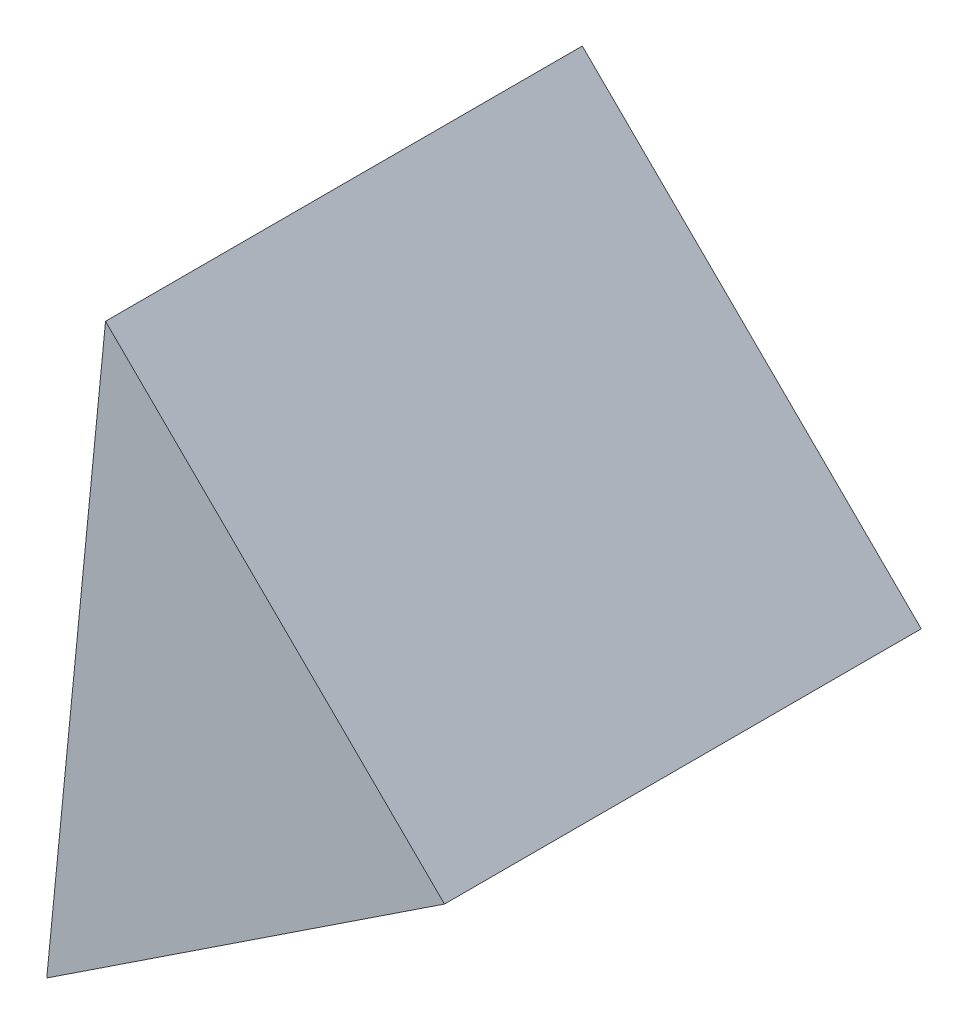
ISO-10303-21;
HEADER;
FILE_DESCRIPTION(('STEP AP214'),'2;1');
FILE_NAME('part.step','',(''),(''),'','','');
FILE_SCHEMA(('AUTOMOTIVE_DESIGN { 1 0 10303 214 1 1 1 1 }'));
ENDSEC;
DATA;
#1=APPLICATION_CONTEXT('core data for automotive mechanical design processes');
#2=APPLICATION_PROTOCOL_DEFINITION('international standard','automotive_design',2000,#1);
#3=PRODUCT_CONTEXT('',#1,'mechanical');
#4=PRODUCT('Part','Part','',(#3));
#5=PRODUCT_RELATED_PRODUCT_CATEGORY('part','',(#4));
#6=PRODUCT_DEFINITION_FORMATION('','',#4);
#7=PRODUCT_DEFINITION_CONTEXT('part definition',#1,'design');
#8=PRODUCT_DEFINITION('design','',#6,#7);
#9=PRODUCT_DEFINITION_SHAPE('','',#8);
#10=(LENGTH_UNIT() NAMED_UNIT(*) SI_UNIT(.MILLI.,.METRE.));
#11=(NAMED_UNIT(*) PLANE_ANGLE_UNIT() SI_UNIT($,.RADIAN.));
#12=(NAMED_UNIT(*) SI_UNIT($,.STERADIAN.) SOLID_ANGLE_UNIT());
#13=UNCERTAINTY_MEASURE_WITH_UNIT(LENGTH_MEASURE(1.E-05),#10,'distance_accuracy_value','');
#14=(GEOMETRIC_REPRESENTATION_CONTEXT(3) GLOBAL_UNCERTAINTY_ASSIGNED_CONTEXT((#13)) GLOBAL_UNIT_ASSIGNED_CONTEXT((#10,
#11,#12)) REPRESENTATION_CONTEXT('',''));
#15=CARTESIAN_POINT('',(0.,0.,0.));
#16=DIRECTION('',(0.,0.,1.));
#17=DIRECTION('',(1.,0.,0.));
#18=AXIS2_PLACEMENT_3D('',#15,#16,#17);
#19=CARTESIAN_POINT('',(17.3709707289566,11.8755016250921,20.));
#20=DIRECTION('',(-0.551401526003401,0.834239987726026,0.));
#21=DIRECTION('',(-0.834239987726026,-0.551401526003401,0.));
#22=AXIS2_PLACEMENT_3D('',#19,#20,#21);
#23=PLANE('',#22);
#24=DIRECTION('',(0.834239987726026,0.551401526003401,0.));
#25=VECTOR('',#24,1.);
#26=CARTESIAN_POINT('',(17.3709707289566,11.8755016250921,0.));
#27=LINE('',#26,#25);
#28=CARTESIAN_POINT('',(0.686170974436035,0.847471105024041,0.));
#29=VERTEX_POINT('',#28);
#30=CARTESIAN_POINT('',(17.3709707289566,11.8755016250921,0.));
#31=VERTEX_POINT('',#30);
#32=EDGE_CURVE('E82',#29,#31,#27,.T.);
#33=ORIENTED_EDGE('',*,*,#32,.T.);
#34=DIRECTION('',(0.,0.,-1.));
#35=VECTOR('',#34,1.);
#36=CARTESIAN_POINT('',(17.3709707289566,11.8755016250921,20.));
#37=LINE('',#36,#35);
#38=CARTESIAN_POINT('',(17.3709707289566,11.8755016250921,20.));
#39=VERTEX_POINT('',#38);
#40=EDGE_CURVE('E11',#39,#31,#37,.T.);
#41=ORIENTED_EDGE('',*,*,#40,.F.);
#42=DIRECTION('',(0.834239987726026,0.551401526003401,0.));
#43=VECTOR('',#42,1.);
#44=CARTESIAN_POINT('',(17.3709707289566,11.8755016250921,20.));
#45=LINE('',#44,#43);
#46=CARTESIAN_POINT('',(0.686170974436035,0.847471105024041,20.));
#47=VERTEX_POINT('',#46);
#48=EDGE_CURVE('E75',#47,#39,#45,.T.);
#49=ORIENTED_EDGE('',*,*,#48,.F.);
#50=DIRECTION('',(0.,0.,-1.));
#51=VECTOR('',#50,1.);
#52=CARTESIAN_POINT('',(0.686170974436035,0.847471105024041,20.));
#53=LINE('',#52,#51);
#54=EDGE_CURVE('E83',#47,#29,#53,.T.);
#55=ORIENTED_EDGE('',*,*,#54,.T.);
#56=EDGE_LOOP('',(#33,#41,#49,#55));
#57=FACE_BOUND('',#56,.T.);
#58=ADVANCED_FACE('F35',(#57),#23,.F.);
#59=CARTESIAN_POINT('',(17.3709707289566,11.8755016250921,20.));
#60=DIRECTION('',(-0.703219485005664,-0.710972823607463,0.));
#61=DIRECTION('',(0.710972823607463,-0.703219485005664,0.));
#62=AXIS2_PLACEMENT_3D('',#59,#60,#61);
#63=PLANE('',#62);
#64=DIRECTION('',(-0.710972823607463,0.703219485005664,0.));
#65=VECTOR('',#64,1.);
#66=CARTESIAN_POINT('',(17.3709707289566,11.8755016250921,0.));
#67=LINE('',#66,#65);
#68=CARTESIAN_POINT('',(3.1515142568073,25.9398913252053,0.));
#69=VERTEX_POINT('',#68);
#70=EDGE_CURVE('E63',#31,#69,#67,.T.);
#71=ORIENTED_EDGE('',*,*,#70,.T.);
#72=DIRECTION('',(0.,0.,-1.));
#73=VECTOR('',#72,1.);
#74=CARTESIAN_POINT('',(3.1515142568073,25.9398913252053,20.));
#75=LINE('',#74,#73);
#76=CARTESIAN_POINT('',(3.1515142568073,25.9398913252053,20.));
#77=VERTEX_POINT('',#76);
#78=EDGE_CURVE('E43',#77,#69,#75,.T.);
#79=ORIENTED_EDGE('',*,*,#78,.F.);
#80=DIRECTION('',(-0.710972823607463,0.703219485005664,0.));
#81=VECTOR('',#80,1.);
#82=CARTESIAN_POINT('',(17.3709707289566,11.8755016250921,20.));
#83=LINE('',#82,#81);
#84=EDGE_CURVE('E71',#39,#77,#83,.T.);
#85=ORIENTED_EDGE('',*,*,#84,.F.);
#86=ORIENTED_EDGE('',*,*,#40,.T.);
#87=EDGE_LOOP('',(#71,#79,#85,#86));
#88=FACE_BOUND('',#87,.T.);
#89=ADVANCED_FACE('F72',(#88),#63,.F.);
#90=CARTESIAN_POINT('',(0.686170974436035,0.847471105024041,20.));
#91=DIRECTION('',(0.995208082962372,-0.0977797095841536,0.));
#92=DIRECTION('',(0.0977797095841536,0.995208082962372,0.));
#93=AXIS2_PLACEMENT_3D('',#90,#91,#92);
#94=PLANE('',#93);
#95=DIRECTION('',(-0.0977797095841536,-0.995208082962372,0.));
#96=VECTOR('',#95,1.);
#97=CARTESIAN_POINT('',(0.686170974436035,0.847471105024041,0.));
#98=LINE('',#97,#96);
#99=EDGE_CURVE('E68',#69,#29,#98,.T.);
#100=ORIENTED_EDGE('',*,*,#99,.T.);
#101=ORIENTED_EDGE('',*,*,#54,.F.);
#102=DIRECTION('',(-0.0977797095841536,-0.995208082962372,0.));
#103=VECTOR('',#102,1.);
#104=CARTESIAN_POINT('',(0.686170974436035,0.847471105024041,20.));
#105=LINE('',#104,#103);
#106=EDGE_CURVE('E51',#77,#47,#105,.T.);
#107=ORIENTED_EDGE('',*,*,#106,.F.);
#108=ORIENTED_EDGE('',*,*,#78,.T.);
#109=EDGE_LOOP('',(#100,#101,#107,#108));
#110=FACE_BOUND('',#109,.T.);
#111=ADVANCED_FACE('F90',(#110),#94,.F.);
#112=CARTESIAN_POINT('',(0.,0.,20.));
#113=DIRECTION('',(0.,0.,-1.));
#114=DIRECTION('',(-1.,0.,0.));
#115=AXIS2_PLACEMENT_3D('',#112,#113,#114);
#116=PLANE('',#115);
#117=ORIENTED_EDGE('',*,*,#48,.T.);
#118=ORIENTED_EDGE('',*,*,#84,.T.);
#119=ORIENTED_EDGE('',*,*,#106,.T.);
#120=EDGE_LOOP('',(#117,#118,#119));
#121=FACE_BOUND('',#120,.T.);
#122=ADVANCED_FACE('F78',(#121),#116,.F.);
#123=CARTESIAN_POINT('',(0.,0.,0.));
#124=DIRECTION('',(0.,0.,-1.));
#125=DIRECTION('',(-1.,0.,0.));
#126=AXIS2_PLACEMENT_3D('',#123,#124,#125);
#127=PLANE('',#126);
#128=ORIENTED_EDGE('',*,*,#32,.F.);
#129=ORIENTED_EDGE('',*,*,#99,.F.);
#130=ORIENTED_EDGE('',*,*,#70,.F.);
#131=EDGE_LOOP('',(#128,#129,#130));
#132=FACE_BOUND('',#131,.T.);
#133=ADVANCED_FACE('F91',(#132),#127,.T.);
#134=CLOSED_SHELL('',(#58,#89,#111,#122,#133));
#135=MANIFOLD_SOLID_BREP('B2',#134);
#136=ADVANCED_BREP_SHAPE_REPRESENTATION('',(#18,#135),#14);
#137=SHAPE_DEFINITION_REPRESENTATION(#9,#136);
ENDSEC;
END-ISO-10303-21;
